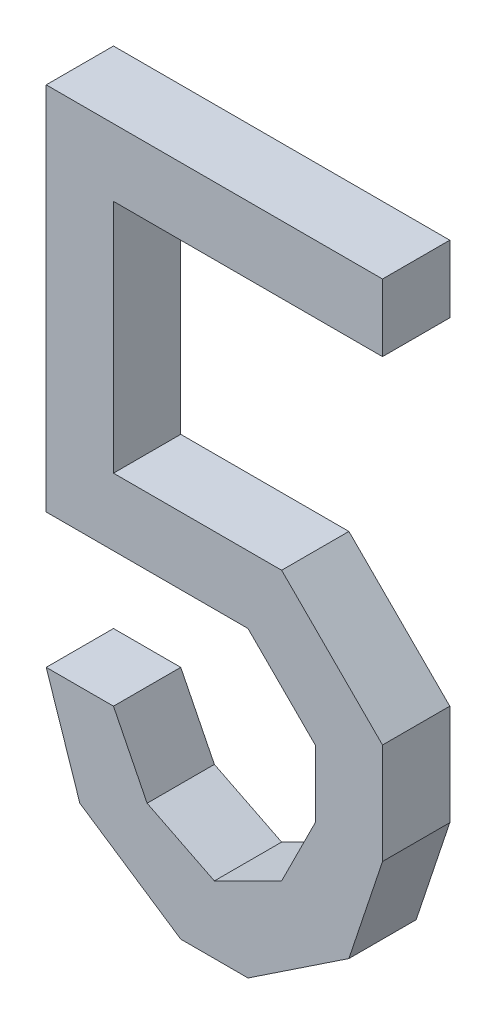
ISO-10303-21;
HEADER;
FILE_DESCRIPTION(('STEP AP214'),'2;1');
FILE_NAME('part.step','',(''),(''),'','','');
FILE_SCHEMA(('AUTOMOTIVE_DESIGN { 1 0 10303 214 1 1 1 1 }'));
ENDSEC;
DATA;
#1=APPLICATION_CONTEXT('core data for automotive mechanical design processes');
#2=APPLICATION_PROTOCOL_DEFINITION('international standard','automotive_design',2000,#1);
#3=PRODUCT_CONTEXT('',#1,'mechanical');
#4=PRODUCT('Part','Part','',(#3));
#5=PRODUCT_RELATED_PRODUCT_CATEGORY('part','',(#4));
#6=PRODUCT_DEFINITION_FORMATION('','',#4);
#7=PRODUCT_DEFINITION_CONTEXT('part definition',#1,'design');
#8=PRODUCT_DEFINITION('design','',#6,#7);
#9=PRODUCT_DEFINITION_SHAPE('','',#8);
#10=(LENGTH_UNIT() NAMED_UNIT(*) SI_UNIT(.MILLI.,.METRE.));
#11=(NAMED_UNIT(*) PLANE_ANGLE_UNIT() SI_UNIT($,.RADIAN.));
#12=(NAMED_UNIT(*) SI_UNIT($,.STERADIAN.) SOLID_ANGLE_UNIT());
#13=UNCERTAINTY_MEASURE_WITH_UNIT(LENGTH_MEASURE(1.E-05),#10,'distance_accuracy_value','');
#14=(GEOMETRIC_REPRESENTATION_CONTEXT(3) GLOBAL_UNCERTAINTY_ASSIGNED_CONTEXT((#13)) GLOBAL_UNIT_ASSIGNED_CONTEXT((#10,
#11,#12)) REPRESENTATION_CONTEXT('',''));
#15=CARTESIAN_POINT('',(0.,0.,0.));
#16=DIRECTION('',(0.,0.,1.));
#17=DIRECTION('',(1.,0.,0.));
#18=AXIS2_PLACEMENT_3D('',#15,#16,#17);
#19=CARTESIAN_POINT('',(0.0635,0.127,0.0254));
#20=DIRECTION('',(0.,0.,1.));
#21=DIRECTION('',(1.,0.,0.));
#22=AXIS2_PLACEMENT_3D('',#19,#20,#21);
#23=PLANE('',#22);
#24=DIRECTION('',(1.,0.,0.));
#25=VECTOR('',#24,1.);
#26=CARTESIAN_POINT('',(0.0635,0.1016,0.0254));
#27=LINE('',#26,#25);
#28=CARTESIAN_POINT('',(0.0635,0.1016,0.0254));
#29=VERTEX_POINT('',#28);
#30=CARTESIAN_POINT('',(-0.0381,0.1016,0.0254));
#31=VERTEX_POINT('',#30);
#32=EDGE_CURVE('E247',#29,#31,#27,.F.);
#33=ORIENTED_EDGE('',*,*,#32,.F.);
#34=DIRECTION('',(0.,1.,0.));
#35=VECTOR('',#34,1.);
#36=CARTESIAN_POINT('',(0.0635,0.127,0.0254));
#37=LINE('',#36,#35);
#38=CARTESIAN_POINT('',(0.0635,0.127,0.0254));
#39=VERTEX_POINT('',#38);
#40=EDGE_CURVE('E172',#39,#29,#37,.F.);
#41=ORIENTED_EDGE('',*,*,#40,.F.);
#42=DIRECTION('',(1.,0.,0.));
#43=VECTOR('',#42,1.);
#44=CARTESIAN_POINT('',(-0.06349999999999,0.127,0.0254));
#45=LINE('',#44,#43);
#46=CARTESIAN_POINT('',(-0.06349999999999,0.127,0.0254));
#47=VERTEX_POINT('',#46);
#48=EDGE_CURVE('E20',#47,#39,#45,.T.);
#49=ORIENTED_EDGE('',*,*,#48,.F.);
#50=DIRECTION('',(0.,1.,0.));
#51=VECTOR('',#50,1.);
#52=CARTESIAN_POINT('',(-0.06349999999999,-0.0127,0.0254));
#53=LINE('',#52,#51);
#54=CARTESIAN_POINT('',(-0.06349999999999,-0.0127,0.0254));
#55=VERTEX_POINT('',#54);
#56=EDGE_CURVE('E161',#55,#47,#53,.T.);
#57=ORIENTED_EDGE('',*,*,#56,.F.);
#58=DIRECTION('',(1.,0.,0.));
#59=VECTOR('',#58,1.);
#60=CARTESIAN_POINT('',(0.01270000000001,-0.0127,0.0254));
#61=LINE('',#60,#59);
#62=CARTESIAN_POINT('',(0.01270000000001,-0.0127,0.0254));
#63=VERTEX_POINT('',#62);
#64=EDGE_CURVE('E156',#63,#55,#61,.F.);
#65=ORIENTED_EDGE('',*,*,#64,.F.);
#66=DIRECTION('',(0.707106781186548,-0.707106781186548,0.));
#67=VECTOR('',#66,1.);
#68=CARTESIAN_POINT('',(0.0381,-0.03809999999999,0.0254));
#69=LINE('',#68,#67);
#70=CARTESIAN_POINT('',(0.0381,-0.03809999999999,0.0254));
#71=VERTEX_POINT('',#70);
#72=EDGE_CURVE('E183',#71,#63,#69,.F.);
#73=ORIENTED_EDGE('',*,*,#72,.F.);
#74=DIRECTION('',(0.,1.,0.));
#75=VECTOR('',#74,1.);
#76=CARTESIAN_POINT('',(0.0381,-0.0635,0.0254));
#77=LINE('',#76,#75);
#78=CARTESIAN_POINT('',(0.0381,-0.0634999999999999,0.0254));
#79=VERTEX_POINT('',#78);
#80=EDGE_CURVE('E187',#79,#71,#77,.T.);
#81=ORIENTED_EDGE('',*,*,#80,.F.);
#82=DIRECTION('',(-0.447213595499958,-0.894427190999916,0.));
#83=VECTOR('',#82,1.);
#84=CARTESIAN_POINT('',(0.0254,-0.0889,0.0254));
#85=LINE('',#84,#83);
#86=CARTESIAN_POINT('',(0.0254,-0.0889,0.0254));
#87=VERTEX_POINT('',#86);
#88=EDGE_CURVE('E191',#87,#79,#85,.F.);
#89=ORIENTED_EDGE('',*,*,#88,.F.);
#90=DIRECTION('',(-0.894427190999916,-0.447213595499958,0.));
#91=VECTOR('',#90,1.);
#92=CARTESIAN_POINT('',(0.,-0.1016,0.0254));
#93=LINE('',#92,#91);
#94=CARTESIAN_POINT('',(0.,-0.101599999999999,0.0254));
#95=VERTEX_POINT('',#94);
#96=EDGE_CURVE('E195',#95,#87,#93,.F.);
#97=ORIENTED_EDGE('',*,*,#96,.F.);
#98=DIRECTION('',(-0.894427190999916,0.447213595499958,0.));
#99=VECTOR('',#98,1.);
#100=CARTESIAN_POINT('',(-0.02539999999999,-0.0889,0.0254));
#101=LINE('',#100,#99);
#102=CARTESIAN_POINT('',(-0.025399999999992,-0.088900000000001,0.0254));
#103=VERTEX_POINT('',#102);
#104=EDGE_CURVE('E199',#103,#95,#101,.F.);
#105=ORIENTED_EDGE('',*,*,#104,.F.);
#106=DIRECTION('',(-0.447213595499958,0.894427190999916,0.));
#107=VECTOR('',#106,1.);
#108=CARTESIAN_POINT('',(-0.0381,-0.0635,0.0254));
#109=LINE('',#108,#107);
#110=CARTESIAN_POINT('',(-0.0381,-0.0635,0.0254));
#111=VERTEX_POINT('',#110);
#112=EDGE_CURVE('E203',#111,#103,#109,.F.);
#113=ORIENTED_EDGE('',*,*,#112,.F.);
#114=DIRECTION('',(1.,0.,0.));
#115=VECTOR('',#114,1.);
#116=CARTESIAN_POINT('',(-0.06349999999999,-0.0635,0.0254));
#117=LINE('',#116,#115);
#118=CARTESIAN_POINT('',(-0.0634999999999922,-0.0635000000000008,0.0254));
#119=VERTEX_POINT('',#118);
#120=EDGE_CURVE('E207',#119,#111,#117,.T.);
#121=ORIENTED_EDGE('',*,*,#120,.F.);
#122=DIRECTION('',(0.316227766016838,-0.948683298050514,0.));
#123=VECTOR('',#122,1.);
#124=CARTESIAN_POINT('',(-0.0508,-0.1016,0.0254));
#125=LINE('',#124,#123);
#126=CARTESIAN_POINT('',(-0.0508000000000018,-0.101600000000003,0.0254));
#127=VERTEX_POINT('',#126);
#128=EDGE_CURVE('E211',#127,#119,#125,.F.);
#129=ORIENTED_EDGE('',*,*,#128,.F.);
#130=DIRECTION('',(0.832050294337997,-0.554700196224998,0.));
#131=VECTOR('',#130,1.);
#132=CARTESIAN_POINT('',(-0.0127,-0.127,0.0254));
#133=LINE('',#132,#131);
#134=CARTESIAN_POINT('',(-0.0127,-0.127,0.0254));
#135=VERTEX_POINT('',#134);
#136=EDGE_CURVE('E215',#135,#127,#133,.F.);
#137=ORIENTED_EDGE('',*,*,#136,.F.);
#138=DIRECTION('',(1.,0.,0.));
#139=VECTOR('',#138,1.);
#140=CARTESIAN_POINT('',(0.01270000000001,-0.127,0.0254));
#141=LINE('',#140,#139);
#142=CARTESIAN_POINT('',(0.0127000000000082,-0.126999999999997,0.0254));
#143=VERTEX_POINT('',#142);
#144=EDGE_CURVE('E219',#143,#135,#141,.F.);
#145=ORIENTED_EDGE('',*,*,#144,.F.);
#146=DIRECTION('',(0.832050294337997,0.554700196224998,0.));
#147=VECTOR('',#146,1.);
#148=CARTESIAN_POINT('',(0.05080000000001,-0.1016,0.0254));
#149=LINE('',#148,#147);
#150=CARTESIAN_POINT('',(0.0508000000000077,-0.101599999999999,0.0254));
#151=VERTEX_POINT('',#150);
#152=EDGE_CURVE('E223',#151,#143,#149,.F.);
#153=ORIENTED_EDGE('',*,*,#152,.F.);
#154=DIRECTION('',(0.316227766016838,0.948683298050514,0.));
#155=VECTOR('',#154,1.);
#156=CARTESIAN_POINT('',(0.0635,-0.0635,0.0254));
#157=LINE('',#156,#155);
#158=CARTESIAN_POINT('',(0.0635,-0.0635,0.0254));
#159=VERTEX_POINT('',#158);
#160=EDGE_CURVE('E227',#159,#151,#157,.F.);
#161=ORIENTED_EDGE('',*,*,#160,.F.);
#162=DIRECTION('',(0.,1.,0.));
#163=VECTOR('',#162,1.);
#164=CARTESIAN_POINT('',(0.0635,-0.02539999999999,0.0254));
#165=LINE('',#164,#163);
#166=CARTESIAN_POINT('',(0.0635000000000055,-0.0253999999999845,0.0254));
#167=VERTEX_POINT('',#166);
#168=EDGE_CURVE('E231',#167,#159,#165,.F.);
#169=ORIENTED_EDGE('',*,*,#168,.F.);
#170=DIRECTION('',(-0.707106781187048,0.707106781186048,0.));
#171=VECTOR('',#170,1.);
#172=CARTESIAN_POINT('',(0.0254,0.0127,0.0254));
#173=LINE('',#172,#171);
#174=CARTESIAN_POINT('',(0.0254,0.0127,0.0254));
#175=VERTEX_POINT('',#174);
#176=EDGE_CURVE('E235',#175,#167,#173,.F.);
#177=ORIENTED_EDGE('',*,*,#176,.F.);
#178=DIRECTION('',(1.,0.,0.));
#179=VECTOR('',#178,1.);
#180=CARTESIAN_POINT('',(-0.0381,0.0127,0.0254));
#181=LINE('',#180,#179);
#182=CARTESIAN_POINT('',(-0.0381,0.0127,0.0254));
#183=VERTEX_POINT('',#182);
#184=EDGE_CURVE('E239',#183,#175,#181,.T.);
#185=ORIENTED_EDGE('',*,*,#184,.F.);
#186=DIRECTION('',(0.,1.,0.));
#187=VECTOR('',#186,1.);
#188=CARTESIAN_POINT('',(-0.0381,0.1016,0.0254));
#189=LINE('',#188,#187);
#190=EDGE_CURVE('E243',#31,#183,#189,.F.);
#191=ORIENTED_EDGE('',*,*,#190,.F.);
#192=EDGE_LOOP('',(#33,#41,#49,#57,#65,#73,#81,#89,#97,#105,#113,#121,#129,#137,#145,#153,#161,
#169,#177,#185,#191));
#193=FACE_BOUND('',#192,.T.);
#194=ADVANCED_FACE('F17',(#193),#23,.T.);
#195=CARTESIAN_POINT('',(-0.06349999999999,0.127,0.));
#196=DIRECTION('',(0.,1.,0.));
#197=DIRECTION('',(0.,0.,1.));
#198=AXIS2_PLACEMENT_3D('',#195,#196,#197);
#199=PLANE('',#198);
#200=DIRECTION('',(0.,0.,-1.));
#201=VECTOR('',#200,1.);
#202=CARTESIAN_POINT('',(0.0635,0.127,0.));
#203=LINE('',#202,#201);
#204=CARTESIAN_POINT('',(0.0635,0.127,0.));
#205=VERTEX_POINT('',#204);
#206=EDGE_CURVE('E251',#205,#39,#203,.F.);
#207=ORIENTED_EDGE('',*,*,#206,.F.);
#208=DIRECTION('',(1.,0.,0.));
#209=VECTOR('',#208,1.);
#210=CARTESIAN_POINT('',(0.0635,0.127,0.));
#211=LINE('',#210,#209);
#212=CARTESIAN_POINT('',(-0.06349999999999,0.127,0.));
#213=VERTEX_POINT('',#212);
#214=EDGE_CURVE('E178',#205,#213,#211,.F.);
#215=ORIENTED_EDGE('',*,*,#214,.T.);
#216=DIRECTION('',(0.,0.,1.));
#217=VECTOR('',#216,1.);
#218=CARTESIAN_POINT('',(-0.06349999999999,0.127,0.));
#219=LINE('',#218,#217);
#220=EDGE_CURVE('E166',#47,#213,#219,.F.);
#221=ORIENTED_EDGE('',*,*,#220,.F.);
#222=ORIENTED_EDGE('',*,*,#48,.T.);
#223=EDGE_LOOP('',(#207,#215,#221,#222));
#224=FACE_BOUND('',#223,.T.);
#225=ADVANCED_FACE('F177',(#224),#199,.T.);
#226=CARTESIAN_POINT('',(-0.06349999999999,-0.0127,0.));
#227=DIRECTION('',(-1.,0.,0.));
#228=DIRECTION('',(0.,0.,1.));
#229=AXIS2_PLACEMENT_3D('',#226,#227,#228);
#230=PLANE('',#229);
#231=ORIENTED_EDGE('',*,*,#220,.T.);
#232=DIRECTION('',(0.,1.,0.));
#233=VECTOR('',#232,1.);
#234=CARTESIAN_POINT('',(-0.06349999999999,0.127,0.));
#235=LINE('',#234,#233);
#236=CARTESIAN_POINT('',(-0.06349999999999,-0.0127,0.));
#237=VERTEX_POINT('',#236);
#238=EDGE_CURVE('E256',#213,#237,#235,.F.);
#239=ORIENTED_EDGE('',*,*,#238,.T.);
#240=DIRECTION('',(0.,0.,-1.));
#241=VECTOR('',#240,1.);
#242=CARTESIAN_POINT('',(-0.06349999999999,-0.0127,0.));
#243=LINE('',#242,#241);
#244=EDGE_CURVE('E168',#55,#237,#243,.T.);
#245=ORIENTED_EDGE('',*,*,#244,.F.);
#246=ORIENTED_EDGE('',*,*,#56,.T.);
#247=EDGE_LOOP('',(#231,#239,#245,#246));
#248=FACE_BOUND('',#247,.T.);
#249=ADVANCED_FACE('F163',(#248),#230,.T.);
#250=CARTESIAN_POINT('',(0.01270000000001,-0.0127,0.));
#251=DIRECTION('',(0.,-1.,0.));
#252=DIRECTION('',(0.,0.,-1.));
#253=AXIS2_PLACEMENT_3D('',#250,#251,#252);
#254=PLANE('',#253);
#255=ORIENTED_EDGE('',*,*,#244,.T.);
#256=DIRECTION('',(1.,0.,0.));
#257=VECTOR('',#256,1.);
#258=CARTESIAN_POINT('',(0.0635,-0.0127,0.));
#259=LINE('',#258,#257);
#260=CARTESIAN_POINT('',(0.01270000000001,-0.0127,0.));
#261=VERTEX_POINT('',#260);
#262=EDGE_CURVE('E258',#237,#261,#259,.T.);
#263=ORIENTED_EDGE('',*,*,#262,.T.);
#264=DIRECTION('',(0.,0.,1.));
#265=VECTOR('',#264,1.);
#266=CARTESIAN_POINT('',(0.01270000000001,-0.0127,0.));
#267=LINE('',#266,#265);
#268=EDGE_CURVE('E185',#63,#261,#267,.F.);
#269=ORIENTED_EDGE('',*,*,#268,.F.);
#270=ORIENTED_EDGE('',*,*,#64,.T.);
#271=EDGE_LOOP('',(#255,#263,#269,#270));
#272=FACE_BOUND('',#271,.T.);
#273=ADVANCED_FACE('F396',(#272),#254,.T.);
#274=CARTESIAN_POINT('',(0.0381,-0.03809999999999,0.));
#275=DIRECTION('',(-0.707106781186548,-0.707106781186548,0.));
#276=DIRECTION('',(0.707106781186548,-0.707106781186548,0.));
#277=AXIS2_PLACEMENT_3D('',#274,#275,#276);
#278=PLANE('',#277);
#279=ORIENTED_EDGE('',*,*,#268,.T.);
#280=DIRECTION('',(0.707106781186548,-0.707106781186547,0.));
#281=VECTOR('',#280,1.);
#282=CARTESIAN_POINT('',(0.01270000000001,-0.0127,0.));
#283=LINE('',#282,#281);
#284=CARTESIAN_POINT('',(0.0381,-0.03809999999999,0.));
#285=VERTEX_POINT('',#284);
#286=EDGE_CURVE('E261',#261,#285,#283,.T.);
#287=ORIENTED_EDGE('',*,*,#286,.T.);
#288=DIRECTION('',(0.,0.,1.));
#289=VECTOR('',#288,1.);
#290=CARTESIAN_POINT('',(0.0381,-0.03809999999999,0.));
#291=LINE('',#290,#289);
#292=EDGE_CURVE('E189',#71,#285,#291,.F.);
#293=ORIENTED_EDGE('',*,*,#292,.F.);
#294=ORIENTED_EDGE('',*,*,#72,.T.);
#295=EDGE_LOOP('',(#279,#287,#293,#294));
#296=FACE_BOUND('',#295,.T.);
#297=ADVANCED_FACE('F394',(#296),#278,.T.);
#298=CARTESIAN_POINT('',(0.0381,-0.0635,0.));
#299=DIRECTION('',(-1.,0.,0.));
#300=DIRECTION('',(0.,0.,1.));
#301=AXIS2_PLACEMENT_3D('',#298,#299,#300);
#302=PLANE('',#301);
#303=ORIENTED_EDGE('',*,*,#292,.T.);
#304=DIRECTION('',(0.,1.,0.));
#305=VECTOR('',#304,1.);
#306=CARTESIAN_POINT('',(0.0381,0.127,0.));
#307=LINE('',#306,#305);
#308=CARTESIAN_POINT('',(0.0381,-0.0635,0.));
#309=VERTEX_POINT('',#308);
#310=EDGE_CURVE('E264',#285,#309,#307,.F.);
#311=ORIENTED_EDGE('',*,*,#310,.T.);
#312=DIRECTION('',(0.,0.,1.));
#313=VECTOR('',#312,1.);
#314=CARTESIAN_POINT('',(0.0381,-0.0635,0.));
#315=LINE('',#314,#313);
#316=EDGE_CURVE('E193',#79,#309,#315,.F.);
#317=ORIENTED_EDGE('',*,*,#316,.F.);
#318=ORIENTED_EDGE('',*,*,#80,.T.);
#319=EDGE_LOOP('',(#303,#311,#317,#318));
#320=FACE_BOUND('',#319,.T.);
#321=ADVANCED_FACE('F390',(#320),#302,.T.);
#322=CARTESIAN_POINT('',(0.0254,-0.0889,0.));
#323=DIRECTION('',(-0.894427190999916,0.447213595499958,0.));
#324=DIRECTION('',(-0.447213595499958,-0.894427190999916,0.));
#325=AXIS2_PLACEMENT_3D('',#322,#323,#324);
#326=PLANE('',#325);
#327=ORIENTED_EDGE('',*,*,#316,.T.);
#328=DIRECTION('',(-0.447213595499958,-0.894427190999916,0.));
#329=VECTOR('',#328,1.);
#330=CARTESIAN_POINT('',(0.0381,-0.0635,0.));
#331=LINE('',#330,#329);
#332=CARTESIAN_POINT('',(0.0254,-0.0889,0.));
#333=VERTEX_POINT('',#332);
#334=EDGE_CURVE('E267',#309,#333,#331,.T.);
#335=ORIENTED_EDGE('',*,*,#334,.T.);
#336=DIRECTION('',(0.,0.,1.));
#337=VECTOR('',#336,1.);
#338=CARTESIAN_POINT('',(0.0254,-0.0889,0.));
#339=LINE('',#338,#337);
#340=EDGE_CURVE('E197',#87,#333,#339,.F.);
#341=ORIENTED_EDGE('',*,*,#340,.F.);
#342=ORIENTED_EDGE('',*,*,#88,.T.);
#343=EDGE_LOOP('',(#327,#335,#341,#342));
#344=FACE_BOUND('',#343,.T.);
#345=ADVANCED_FACE('F384',(#344),#326,.T.);
#346=CARTESIAN_POINT('',(0.,-0.1016,0.));
#347=DIRECTION('',(-0.447213595499958,0.894427190999916,0.));
#348=DIRECTION('',(-0.894427190999916,-0.447213595499958,0.));
#349=AXIS2_PLACEMENT_3D('',#346,#347,#348);
#350=PLANE('',#349);
#351=ORIENTED_EDGE('',*,*,#340,.T.);
#352=DIRECTION('',(-0.894427190999916,-0.447213595499958,0.));
#353=VECTOR('',#352,1.);
#354=CARTESIAN_POINT('',(0.0254,-0.0889,0.));
#355=LINE('',#354,#353);
#356=CARTESIAN_POINT('',(0.,-0.101599999999999,0.));
#357=VERTEX_POINT('',#356);
#358=EDGE_CURVE('E270',#333,#357,#355,.T.);
#359=ORIENTED_EDGE('',*,*,#358,.T.);
#360=DIRECTION('',(0.,0.,1.));
#361=VECTOR('',#360,1.);
#362=CARTESIAN_POINT('',(0.,-0.101599999999996,0.));
#363=LINE('',#362,#361);
#364=EDGE_CURVE('E201',#95,#357,#363,.F.);
#365=ORIENTED_EDGE('',*,*,#364,.F.);
#366=ORIENTED_EDGE('',*,*,#96,.T.);
#367=EDGE_LOOP('',(#351,#359,#365,#366));
#368=FACE_BOUND('',#367,.T.);
#369=ADVANCED_FACE('F380',(#368),#350,.T.);
#370=CARTESIAN_POINT('',(-0.02539999999999,-0.0889,0.));
#371=DIRECTION('',(0.447213595499958,0.894427190999916,0.));
#372=DIRECTION('',(-0.894427190999916,0.447213595499958,0.));
#373=AXIS2_PLACEMENT_3D('',#370,#371,#372);
#374=PLANE('',#373);
#375=ORIENTED_EDGE('',*,*,#364,.T.);
#376=DIRECTION('',(-0.894427190999845,0.447213595500099,0.));
#377=VECTOR('',#376,1.);
#378=CARTESIAN_POINT('',(0.,-0.1016,0.));
#379=LINE('',#378,#377);
#380=CARTESIAN_POINT('',(-0.025399999999992,-0.088900000000001,0.));
#381=VERTEX_POINT('',#380);
#382=EDGE_CURVE('E273',#357,#381,#379,.T.);
#383=ORIENTED_EDGE('',*,*,#382,.T.);
#384=DIRECTION('',(0.,0.,1.));
#385=VECTOR('',#384,1.);
#386=CARTESIAN_POINT('',(-0.025399999999998,-0.088900000000004,0.));
#387=LINE('',#386,#385);
#388=EDGE_CURVE('E205',#103,#381,#387,.F.);
#389=ORIENTED_EDGE('',*,*,#388,.F.);
#390=ORIENTED_EDGE('',*,*,#104,.T.);
#391=EDGE_LOOP('',(#375,#383,#389,#390));
#392=FACE_BOUND('',#391,.T.);
#393=ADVANCED_FACE('F374',(#392),#374,.T.);
#394=CARTESIAN_POINT('',(-0.0381,-0.0635,0.));
#395=DIRECTION('',(0.894427190999916,0.447213595499958,0.));
#396=DIRECTION('',(-0.447213595499958,0.894427190999916,0.));
#397=AXIS2_PLACEMENT_3D('',#394,#395,#396);
#398=PLANE('',#397);
#399=ORIENTED_EDGE('',*,*,#388,.T.);
#400=DIRECTION('',(-0.44721359550024,0.894427190999775,0.));
#401=VECTOR('',#400,1.);
#402=CARTESIAN_POINT('',(-0.02539999999999,-0.0889,0.));
#403=LINE('',#402,#401);
#404=CARTESIAN_POINT('',(-0.0381,-0.0635,0.));
#405=VERTEX_POINT('',#404);
#406=EDGE_CURVE('E276',#381,#405,#403,.T.);
#407=ORIENTED_EDGE('',*,*,#406,.T.);
#408=DIRECTION('',(0.,0.,1.));
#409=VECTOR('',#408,1.);
#410=CARTESIAN_POINT('',(-0.0381,-0.0635,0.));
#411=LINE('',#410,#409);
#412=EDGE_CURVE('E209',#111,#405,#411,.F.);
#413=ORIENTED_EDGE('',*,*,#412,.F.);
#414=ORIENTED_EDGE('',*,*,#112,.T.);
#415=EDGE_LOOP('',(#399,#407,#413,#414));
#416=FACE_BOUND('',#415,.T.);
#417=ADVANCED_FACE('F370',(#416),#398,.T.);
#418=CARTESIAN_POINT('',(-0.06349999999999,-0.0635,0.));
#419=DIRECTION('',(0.,1.,0.));
#420=DIRECTION('',(0.,0.,1.));
#421=AXIS2_PLACEMENT_3D('',#418,#419,#420);
#422=PLANE('',#421);
#423=ORIENTED_EDGE('',*,*,#412,.T.);
#424=DIRECTION('',(1.,0.,0.));
#425=VECTOR('',#424,1.);
#426=CARTESIAN_POINT('',(0.0635,-0.0635,0.));
#427=LINE('',#426,#425);
#428=CARTESIAN_POINT('',(-0.0634999999999922,-0.0635000000000008,0.));
#429=VERTEX_POINT('',#428);
#430=EDGE_CURVE('E279',#405,#429,#427,.F.);
#431=ORIENTED_EDGE('',*,*,#430,.T.);
#432=DIRECTION('',(0.,0.,1.));
#433=VECTOR('',#432,1.);
#434=CARTESIAN_POINT('',(-0.063499999999999,-0.063500000000003,0.));
#435=LINE('',#434,#433);
#436=EDGE_CURVE('E213',#119,#429,#435,.F.);
#437=ORIENTED_EDGE('',*,*,#436,.F.);
#438=ORIENTED_EDGE('',*,*,#120,.T.);
#439=EDGE_LOOP('',(#423,#431,#437,#438));
#440=FACE_BOUND('',#439,.T.);
#441=ADVANCED_FACE('F364',(#440),#422,.T.);
#442=CARTESIAN_POINT('',(-0.0508,-0.1016,0.));
#443=DIRECTION('',(-0.948683298050514,-0.316227766016838,0.));
#444=DIRECTION('',(0.316227766016838,-0.948683298050514,0.));
#445=AXIS2_PLACEMENT_3D('',#442,#443,#444);
#446=PLANE('',#445);
#447=ORIENTED_EDGE('',*,*,#436,.T.);
#448=DIRECTION('',(0.316227766016614,-0.948683298050589,0.));
#449=VECTOR('',#448,1.);
#450=CARTESIAN_POINT('',(-0.06349999999999,-0.0635,0.));
#451=LINE('',#450,#449);
#452=CARTESIAN_POINT('',(-0.0508000000000018,-0.101600000000003,0.));
#453=VERTEX_POINT('',#452);
#454=EDGE_CURVE('E282',#429,#453,#451,.T.);
#455=ORIENTED_EDGE('',*,*,#454,.T.);
#456=DIRECTION('',(0.,0.,1.));
#457=VECTOR('',#456,1.);
#458=CARTESIAN_POINT('',(-0.050800000000007,-0.101600000000011,0.));
#459=LINE('',#458,#457);
#460=EDGE_CURVE('E217',#127,#453,#459,.F.);
#461=ORIENTED_EDGE('',*,*,#460,.F.);
#462=ORIENTED_EDGE('',*,*,#128,.T.);
#463=EDGE_LOOP('',(#447,#455,#461,#462));
#464=FACE_BOUND('',#463,.T.);
#465=ADVANCED_FACE('F360',(#464),#446,.T.);
#466=CARTESIAN_POINT('',(-0.0127,-0.127,0.));
#467=DIRECTION('',(-0.554700196224998,-0.832050294337997,0.));
#468=DIRECTION('',(0.832050294337997,-0.554700196224998,0.));
#469=AXIS2_PLACEMENT_3D('',#466,#467,#468);
#470=PLANE('',#469);
#471=ORIENTED_EDGE('',*,*,#460,.T.);
#472=DIRECTION('',(0.832050294337844,-0.554700196225229,0.));
#473=VECTOR('',#472,1.);
#474=CARTESIAN_POINT('',(-0.0508,-0.1016,0.));
#475=LINE('',#474,#473);
#476=CARTESIAN_POINT('',(-0.0127,-0.127,0.));
#477=VERTEX_POINT('',#476);
#478=EDGE_CURVE('E285',#453,#477,#475,.T.);
#479=ORIENTED_EDGE('',*,*,#478,.T.);
#480=DIRECTION('',(0.,0.,-1.));
#481=VECTOR('',#480,1.);
#482=CARTESIAN_POINT('',(-0.0127,-0.127,0.));
#483=LINE('',#482,#481);
#484=EDGE_CURVE('E221',#135,#477,#483,.T.);
#485=ORIENTED_EDGE('',*,*,#484,.F.);
#486=ORIENTED_EDGE('',*,*,#136,.T.);
#487=EDGE_LOOP('',(#471,#479,#485,#486));
#488=FACE_BOUND('',#487,.T.);
#489=ADVANCED_FACE('F354',(#488),#470,.T.);
#490=CARTESIAN_POINT('',(0.01270000000001,-0.127,0.));
#491=DIRECTION('',(0.,-1.,0.));
#492=DIRECTION('',(0.,0.,-1.));
#493=AXIS2_PLACEMENT_3D('',#490,#491,#492);
#494=PLANE('',#493);
#495=ORIENTED_EDGE('',*,*,#484,.T.);
#496=DIRECTION('',(1.,0.,0.));
#497=VECTOR('',#496,1.);
#498=CARTESIAN_POINT('',(0.0635,-0.127,0.));
#499=LINE('',#498,#497);
#500=CARTESIAN_POINT('',(0.0127000000000082,-0.126999999999997,0.));
#501=VERTEX_POINT('',#500);
#502=EDGE_CURVE('E288',#477,#501,#499,.T.);
#503=ORIENTED_EDGE('',*,*,#502,.T.);
#504=DIRECTION('',(0.,0.,1.));
#505=VECTOR('',#504,1.);
#506=CARTESIAN_POINT('',(0.012700000000003,-0.126999999999989,0.));
#507=LINE('',#506,#505);
#508=EDGE_CURVE('E225',#143,#501,#507,.F.);
#509=ORIENTED_EDGE('',*,*,#508,.F.);
#510=ORIENTED_EDGE('',*,*,#144,.T.);
#511=EDGE_LOOP('',(#495,#503,#509,#510));
#512=FACE_BOUND('',#511,.T.);
#513=ADVANCED_FACE('F350',(#512),#494,.T.);
#514=CARTESIAN_POINT('',(0.05080000000001,-0.1016,0.));
#515=DIRECTION('',(0.554700196224998,-0.832050294337997,0.));
#516=DIRECTION('',(0.832050294337997,0.554700196224998,0.));
#517=AXIS2_PLACEMENT_3D('',#514,#515,#516);
#518=PLANE('',#517);
#519=ORIENTED_EDGE('',*,*,#508,.T.);
#520=DIRECTION('',(0.832050294337844,0.554700196225229,0.));
#521=VECTOR('',#520,1.);
#522=CARTESIAN_POINT('',(0.01270000000001,-0.127,0.));
#523=LINE('',#522,#521);
#524=CARTESIAN_POINT('',(0.0508000000000077,-0.101599999999999,0.));
#525=VERTEX_POINT('',#524);
#526=EDGE_CURVE('E291',#501,#525,#523,.T.);
#527=ORIENTED_EDGE('',*,*,#526,.T.);
#528=DIRECTION('',(0.,0.,1.));
#529=VECTOR('',#528,1.);
#530=CARTESIAN_POINT('',(0.050800000000001,-0.101599999999997,0.));
#531=LINE('',#530,#529);
#532=EDGE_CURVE('E229',#151,#525,#531,.F.);
#533=ORIENTED_EDGE('',*,*,#532,.F.);
#534=ORIENTED_EDGE('',*,*,#152,.T.);
#535=EDGE_LOOP('',(#519,#527,#533,#534));
#536=FACE_BOUND('',#535,.T.);
#537=ADVANCED_FACE('F344',(#536),#518,.T.);
#538=CARTESIAN_POINT('',(0.0635,-0.0635,0.));
#539=DIRECTION('',(0.948683298050514,-0.316227766016838,0.));
#540=DIRECTION('',(0.316227766016838,0.948683298050514,0.));
#541=AXIS2_PLACEMENT_3D('',#538,#539,#540);
#542=PLANE('',#541);
#543=ORIENTED_EDGE('',*,*,#532,.T.);
#544=DIRECTION('',(0.316227766016614,0.948683298050589,0.));
#545=VECTOR('',#544,1.);
#546=CARTESIAN_POINT('',(0.05080000000001,-0.1016,0.));
#547=LINE('',#546,#545);
#548=CARTESIAN_POINT('',(0.0635,-0.0635,0.));
#549=VERTEX_POINT('',#548);
#550=EDGE_CURVE('E294',#525,#549,#547,.T.);
#551=ORIENTED_EDGE('',*,*,#550,.T.);
#552=DIRECTION('',(0.,0.,-1.));
#553=VECTOR('',#552,1.);
#554=CARTESIAN_POINT('',(0.0635,-0.0635,0.));
#555=LINE('',#554,#553);
#556=EDGE_CURVE('E233',#159,#549,#555,.T.);
#557=ORIENTED_EDGE('',*,*,#556,.F.);
#558=ORIENTED_EDGE('',*,*,#160,.T.);
#559=EDGE_LOOP('',(#543,#551,#557,#558));
#560=FACE_BOUND('',#559,.T.);
#561=ADVANCED_FACE('F340',(#560),#542,.T.);
#562=CARTESIAN_POINT('',(0.0635,-0.02539999999999,0.));
#563=DIRECTION('',(1.,0.,0.));
#564=DIRECTION('',(0.,0.,-1.));
#565=AXIS2_PLACEMENT_3D('',#562,#563,#564);
#566=PLANE('',#565);
#567=ORIENTED_EDGE('',*,*,#556,.T.);
#568=DIRECTION('',(0.,1.,0.));
#569=VECTOR('',#568,1.);
#570=CARTESIAN_POINT('',(0.0635,0.127,0.));
#571=LINE('',#570,#569);
#572=CARTESIAN_POINT('',(0.0635000000000055,-0.0253999999999845,0.));
#573=VERTEX_POINT('',#572);
#574=EDGE_CURVE('E297',#549,#573,#571,.T.);
#575=ORIENTED_EDGE('',*,*,#574,.T.);
#576=DIRECTION('',(0.,0.,1.));
#577=VECTOR('',#576,1.);
#578=CARTESIAN_POINT('',(0.0635000000000219,-0.0253999999999681,0.));
#579=LINE('',#578,#577);
#580=EDGE_CURVE('E237',#167,#573,#579,.F.);
#581=ORIENTED_EDGE('',*,*,#580,.F.);
#582=ORIENTED_EDGE('',*,*,#168,.T.);
#583=EDGE_LOOP('',(#567,#575,#581,#582));
#584=FACE_BOUND('',#583,.T.);
#585=ADVANCED_FACE('F334',(#584),#566,.T.);
#586=CARTESIAN_POINT('',(0.0254,0.0127,0.));
#587=DIRECTION('',(0.707106781186048,0.707106781187048,0.));
#588=DIRECTION('',(-0.707106781187048,0.707106781186048,0.));
#589=AXIS2_PLACEMENT_3D('',#586,#587,#588);
#590=PLANE('',#589);
#591=ORIENTED_EDGE('',*,*,#580,.T.);
#592=DIRECTION('',(-0.70710678118664,0.707106781186455,0.));
#593=VECTOR('',#592,1.);
#594=CARTESIAN_POINT('',(0.0635,-0.02539999999999,0.));
#595=LINE('',#594,#593);
#596=CARTESIAN_POINT('',(0.0254,0.0127,0.));
#597=VERTEX_POINT('',#596);
#598=EDGE_CURVE('E300',#573,#597,#595,.T.);
#599=ORIENTED_EDGE('',*,*,#598,.T.);
#600=DIRECTION('',(0.,0.,1.));
#601=VECTOR('',#600,1.);
#602=CARTESIAN_POINT('',(0.0254,0.0127,0.));
#603=LINE('',#602,#601);
#604=EDGE_CURVE('E241',#175,#597,#603,.F.);
#605=ORIENTED_EDGE('',*,*,#604,.F.);
#606=ORIENTED_EDGE('',*,*,#176,.T.);
#607=EDGE_LOOP('',(#591,#599,#605,#606));
#608=FACE_BOUND('',#607,.T.);
#609=ADVANCED_FACE('F330',(#608),#590,.T.);
#610=CARTESIAN_POINT('',(-0.0381,0.0127,0.));
#611=DIRECTION('',(0.,1.,0.));
#612=DIRECTION('',(0.,0.,1.));
#613=AXIS2_PLACEMENT_3D('',#610,#611,#612);
#614=PLANE('',#613);
#615=ORIENTED_EDGE('',*,*,#604,.T.);
#616=DIRECTION('',(1.,0.,0.));
#617=VECTOR('',#616,1.);
#618=CARTESIAN_POINT('',(0.0635,0.0127,0.));
#619=LINE('',#618,#617);
#620=CARTESIAN_POINT('',(-0.0381,0.0127,0.));
#621=VERTEX_POINT('',#620);
#622=EDGE_CURVE('E303',#597,#621,#619,.F.);
#623=ORIENTED_EDGE('',*,*,#622,.T.);
#624=DIRECTION('',(0.,0.,-1.));
#625=VECTOR('',#624,1.);
#626=CARTESIAN_POINT('',(-0.0381,0.0127,0.));
#627=LINE('',#626,#625);
#628=EDGE_CURVE('E245',#183,#621,#627,.T.);
#629=ORIENTED_EDGE('',*,*,#628,.F.);
#630=ORIENTED_EDGE('',*,*,#184,.T.);
#631=EDGE_LOOP('',(#615,#623,#629,#630));
#632=FACE_BOUND('',#631,.T.);
#633=ADVANCED_FACE('F324',(#632),#614,.T.);
#634=CARTESIAN_POINT('',(-0.0381,0.1016,0.));
#635=DIRECTION('',(1.,0.,0.));
#636=DIRECTION('',(0.,0.,-1.));
#637=AXIS2_PLACEMENT_3D('',#634,#635,#636);
#638=PLANE('',#637);
#639=ORIENTED_EDGE('',*,*,#628,.T.);
#640=DIRECTION('',(0.,1.,0.));
#641=VECTOR('',#640,1.);
#642=CARTESIAN_POINT('',(-0.0381,0.127,0.));
#643=LINE('',#642,#641);
#644=CARTESIAN_POINT('',(-0.0381,0.1016,0.));
#645=VERTEX_POINT('',#644);
#646=EDGE_CURVE('E306',#621,#645,#643,.T.);
#647=ORIENTED_EDGE('',*,*,#646,.T.);
#648=DIRECTION('',(0.,0.,-1.));
#649=VECTOR('',#648,1.);
#650=CARTESIAN_POINT('',(-0.0381,0.1016,0.));
#651=LINE('',#650,#649);
#652=EDGE_CURVE('E249',#31,#645,#651,.T.);
#653=ORIENTED_EDGE('',*,*,#652,.F.);
#654=ORIENTED_EDGE('',*,*,#190,.T.);
#655=EDGE_LOOP('',(#639,#647,#653,#654));
#656=FACE_BOUND('',#655,.T.);
#657=ADVANCED_FACE('F319',(#656),#638,.T.);
#658=CARTESIAN_POINT('',(0.0635,0.1016,0.));
#659=DIRECTION('',(0.,-1.,0.));
#660=DIRECTION('',(0.,0.,-1.));
#661=AXIS2_PLACEMENT_3D('',#658,#659,#660);
#662=PLANE('',#661);
#663=ORIENTED_EDGE('',*,*,#652,.T.);
#664=DIRECTION('',(1.,0.,0.));
#665=VECTOR('',#664,1.);
#666=CARTESIAN_POINT('',(0.0635,0.1016,0.));
#667=LINE('',#666,#665);
#668=CARTESIAN_POINT('',(0.0635,0.1016,0.));
#669=VERTEX_POINT('',#668);
#670=EDGE_CURVE('E26',#645,#669,#667,.T.);
#671=ORIENTED_EDGE('',*,*,#670,.T.);
#672=DIRECTION('',(0.,0.,-1.));
#673=VECTOR('',#672,1.);
#674=CARTESIAN_POINT('',(0.0635,0.1016,0.));
#675=LINE('',#674,#673);
#676=EDGE_CURVE('E34',#29,#669,#675,.T.);
#677=ORIENTED_EDGE('',*,*,#676,.F.);
#678=ORIENTED_EDGE('',*,*,#32,.T.);
#679=EDGE_LOOP('',(#663,#671,#677,#678));
#680=FACE_BOUND('',#679,.T.);
#681=ADVANCED_FACE('F312',(#680),#662,.T.);
#682=CARTESIAN_POINT('',(0.0635,0.127,0.));
#683=DIRECTION('',(1.,0.,0.));
#684=DIRECTION('',(0.,0.,-1.));
#685=AXIS2_PLACEMENT_3D('',#682,#683,#684);
#686=PLANE('',#685);
#687=ORIENTED_EDGE('',*,*,#676,.T.);
#688=DIRECTION('',(0.,1.,0.));
#689=VECTOR('',#688,1.);
#690=CARTESIAN_POINT('',(0.0635,0.127,0.));
#691=LINE('',#690,#689);
#692=EDGE_CURVE('E11',#669,#205,#691,.T.);
#693=ORIENTED_EDGE('',*,*,#692,.T.);
#694=ORIENTED_EDGE('',*,*,#206,.T.);
#695=ORIENTED_EDGE('',*,*,#40,.T.);
#696=EDGE_LOOP('',(#687,#693,#694,#695));
#697=FACE_BOUND('',#696,.T.);
#698=ADVANCED_FACE('F407',(#697),#686,.T.);
#699=CARTESIAN_POINT('',(0.0635,0.127,0.));
#700=DIRECTION('',(0.,0.,1.));
#701=DIRECTION('',(1.,0.,0.));
#702=AXIS2_PLACEMENT_3D('',#699,#700,#701);
#703=PLANE('',#702);
#704=ORIENTED_EDGE('',*,*,#670,.F.);
#705=ORIENTED_EDGE('',*,*,#646,.F.);
#706=ORIENTED_EDGE('',*,*,#622,.F.);
#707=ORIENTED_EDGE('',*,*,#598,.F.);
#708=ORIENTED_EDGE('',*,*,#574,.F.);
#709=ORIENTED_EDGE('',*,*,#550,.F.);
#710=ORIENTED_EDGE('',*,*,#526,.F.);
#711=ORIENTED_EDGE('',*,*,#502,.F.);
#712=ORIENTED_EDGE('',*,*,#478,.F.);
#713=ORIENTED_EDGE('',*,*,#454,.F.);
#714=ORIENTED_EDGE('',*,*,#430,.F.);
#715=ORIENTED_EDGE('',*,*,#406,.F.);
#716=ORIENTED_EDGE('',*,*,#382,.F.);
#717=ORIENTED_EDGE('',*,*,#358,.F.);
#718=ORIENTED_EDGE('',*,*,#334,.F.);
#719=ORIENTED_EDGE('',*,*,#310,.F.);
#720=ORIENTED_EDGE('',*,*,#286,.F.);
#721=ORIENTED_EDGE('',*,*,#262,.F.);
#722=ORIENTED_EDGE('',*,*,#238,.F.);
#723=ORIENTED_EDGE('',*,*,#214,.F.);
#724=ORIENTED_EDGE('',*,*,#692,.F.);
#725=EDGE_LOOP('',(#704,#705,#706,#707,#708,#709,#710,#711,#712,#713,#714,#715,#716,#717,#718,
#719,#720,#721,#722,#723,#724));
#726=FACE_BOUND('',#725,.T.);
#727=ADVANCED_FACE('F316',(#726),#703,.F.);
#728=CLOSED_SHELL('',(#194,#225,#249,#273,#297,#321,#345,#369,#393,#417,#441,#465,#489,#513,
#537,#561,#585,#609,#633,#657,#681,#698,#727));
#729=MANIFOLD_SOLID_BREP('B1',#728);
#730=ADVANCED_BREP_SHAPE_REPRESENTATION('',(#18,#729),#14);
#731=SHAPE_DEFINITION_REPRESENTATION(#9,#730);
ENDSEC;
END-ISO-10303-21;
